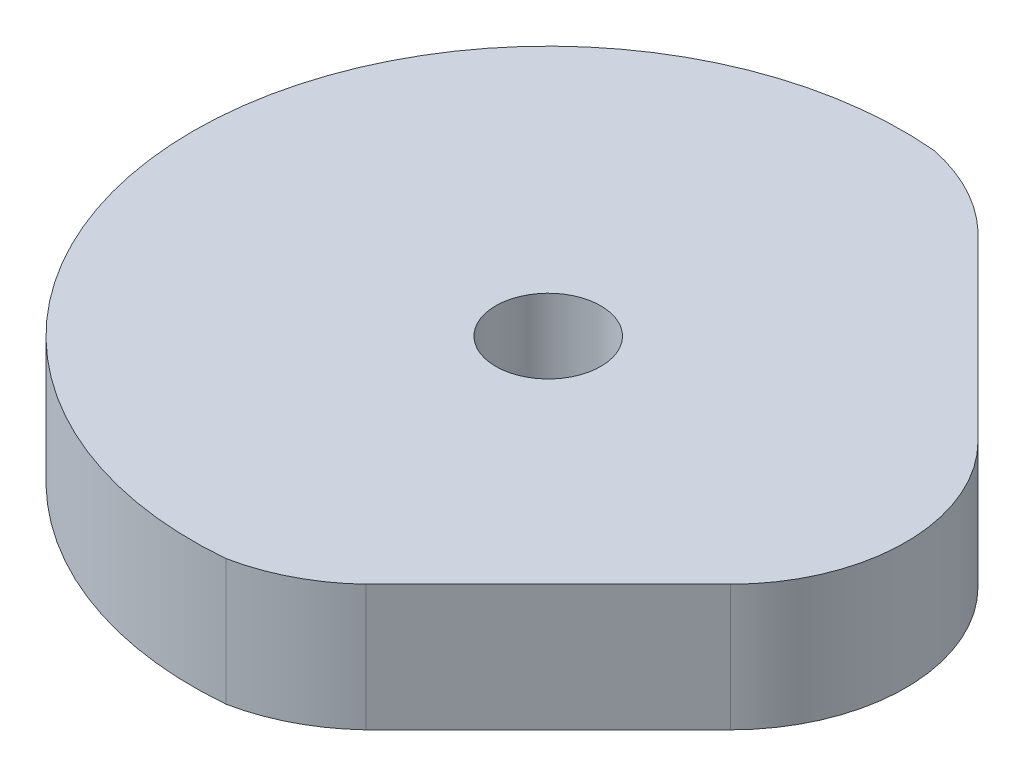
ISO-10303-21;
HEADER;
FILE_DESCRIPTION(('STEP AP214'),'2;1');
FILE_NAME('part.step','',(''),(''),'','','');
FILE_SCHEMA(('AUTOMOTIVE_DESIGN { 1 0 10303 214 1 1 1 1 }'));
ENDSEC;
DATA;
#1=APPLICATION_CONTEXT('core data for automotive mechanical design processes');
#2=APPLICATION_PROTOCOL_DEFINITION('international standard','automotive_design',2000,#1);
#3=PRODUCT_CONTEXT('',#1,'mechanical');
#4=PRODUCT('Part','Part','',(#3));
#5=PRODUCT_RELATED_PRODUCT_CATEGORY('part','',(#4));
#6=PRODUCT_DEFINITION_FORMATION('','',#4);
#7=PRODUCT_DEFINITION_CONTEXT('part definition',#1,'design');
#8=PRODUCT_DEFINITION('design','',#6,#7);
#9=PRODUCT_DEFINITION_SHAPE('','',#8);
#10=(LENGTH_UNIT() NAMED_UNIT(*) SI_UNIT(.MILLI.,.METRE.));
#11=(NAMED_UNIT(*) PLANE_ANGLE_UNIT() SI_UNIT($,.RADIAN.));
#12=(NAMED_UNIT(*) SI_UNIT($,.STERADIAN.) SOLID_ANGLE_UNIT());
#13=UNCERTAINTY_MEASURE_WITH_UNIT(LENGTH_MEASURE(1.E-05),#10,'distance_accuracy_value','');
#14=(GEOMETRIC_REPRESENTATION_CONTEXT(3) GLOBAL_UNCERTAINTY_ASSIGNED_CONTEXT((#13)) GLOBAL_UNIT_ASSIGNED_CONTEXT((#10,
#11,#12)) REPRESENTATION_CONTEXT('',''));
#15=CARTESIAN_POINT('',(0.,0.,0.));
#16=DIRECTION('',(0.,0.,1.));
#17=DIRECTION('',(1.,0.,0.));
#18=AXIS2_PLACEMENT_3D('',#15,#16,#17);
#19=CARTESIAN_POINT('',(-0.124301483345422,3.,-4.03990509591925));
#20=DIRECTION('',(0.,-1.,0.));
#21=DIRECTION('',(0.,0.,-1.));
#22=AXIS2_PLACEMENT_3D('',#19,#20,#21);
#23=CYLINDRICAL_SURFACE('',#22,4.46182669006417);
#24=CARTESIAN_POINT('',(-0.124301483345422,0.,-4.03990509591925));
#25=DIRECTION('',(0.,1.,0.));
#26=DIRECTION('',(0.,0.,1.));
#27=AXIS2_PLACEMENT_3D('',#24,#25,#26);
#28=CIRCLE('',#27,4.46182669006417);
#29=CARTESIAN_POINT('',(0.752637129984886,0.,-8.4147052148526));
#30=VERTEX_POINT('',#29);
#31=CARTESIAN_POINT('',(2.94156744628055,0.,-7.2815628691154));
#32=VERTEX_POINT('',#31);
#33=EDGE_CURVE('E119',#30,#32,#28,.F.);
#34=ORIENTED_EDGE('',*,*,#33,.F.);
#35=DIRECTION('',(0.,-1.,0.));
#36=VECTOR('',#35,1.);
#37=CARTESIAN_POINT('',(0.752637129984886,3.,-8.4147052148526));
#38=LINE('',#37,#36);
#39=CARTESIAN_POINT('',(0.752637129984886,3.,-8.4147052148526));
#40=VERTEX_POINT('',#39);
#41=EDGE_CURVE('E11',#40,#30,#38,.T.);
#42=ORIENTED_EDGE('',*,*,#41,.F.);
#43=CARTESIAN_POINT('',(-0.124301483345422,3.,-4.03990509591925));
#44=DIRECTION('',(0.,1.,0.));
#45=DIRECTION('',(0.,0.,1.));
#46=AXIS2_PLACEMENT_3D('',#43,#44,#45);
#47=CIRCLE('',#46,4.46182669006417);
#48=CARTESIAN_POINT('',(2.94156744628055,3.,-7.2815628691154));
#49=VERTEX_POINT('',#48);
#50=EDGE_CURVE('E170',#40,#49,#47,.F.);
#51=ORIENTED_EDGE('',*,*,#50,.T.);
#52=DIRECTION('',(0.,-1.,0.));
#53=VECTOR('',#52,1.);
#54=CARTESIAN_POINT('',(2.94156744628055,3.,-7.2815628691154));
#55=LINE('',#54,#53);
#56=EDGE_CURVE('E79',#49,#32,#55,.T.);
#57=ORIENTED_EDGE('',*,*,#56,.T.);
#58=EDGE_LOOP('',(#34,#42,#51,#57));
#59=FACE_BOUND('',#58,.T.);
#60=ADVANCED_FACE('F34',(#59),#23,.T.);
#61=CARTESIAN_POINT('',(0.,3.,0.));
#62=DIRECTION('',(0.,-1.,0.));
#63=DIRECTION('',(0.,0.,-1.));
#64=AXIS2_PLACEMENT_3D('',#61,#62,#63);
#65=CYLINDRICAL_SURFACE('',#64,8.44829725461287);
#66=CARTESIAN_POINT('',(0.,0.,0.));
#67=DIRECTION('',(0.,1.,0.));
#68=DIRECTION('',(0.,0.,1.));
#69=AXIS2_PLACEMENT_3D('',#66,#67,#68);
#70=CIRCLE('',#69,8.44829725461287);
#71=CARTESIAN_POINT('',(0.752637129984888,0.,8.4147052148526));
#72=VERTEX_POINT('',#71);
#73=EDGE_CURVE('E122',#30,#72,#70,.T.);
#74=ORIENTED_EDGE('',*,*,#73,.T.);
#75=DIRECTION('',(0.,-1.,0.));
#76=VECTOR('',#75,1.);
#77=CARTESIAN_POINT('',(0.752637129984888,3.,8.4147052148526));
#78=LINE('',#77,#76);
#79=CARTESIAN_POINT('',(0.752637129984888,3.,8.4147052148526));
#80=VERTEX_POINT('',#79);
#81=EDGE_CURVE('E43',#80,#72,#78,.T.);
#82=ORIENTED_EDGE('',*,*,#81,.F.);
#83=CARTESIAN_POINT('',(0.,3.,0.));
#84=DIRECTION('',(0.,1.,0.));
#85=DIRECTION('',(0.,0.,1.));
#86=AXIS2_PLACEMENT_3D('',#83,#84,#85);
#87=CIRCLE('',#86,8.44829725461287);
#88=EDGE_CURVE('E172',#40,#80,#87,.T.);
#89=ORIENTED_EDGE('',*,*,#88,.F.);
#90=ORIENTED_EDGE('',*,*,#41,.T.);
#91=EDGE_LOOP('',(#74,#82,#89,#90));
#92=FACE_BOUND('',#91,.T.);
#93=ADVANCED_FACE('F142',(#92),#65,.T.);
#94=CARTESIAN_POINT('',(-0.124301483345421,3.,4.03990509591925));
#95=DIRECTION('',(0.,-1.,0.));
#96=DIRECTION('',(0.,0.,-1.));
#97=AXIS2_PLACEMENT_3D('',#94,#95,#96);
#98=CYLINDRICAL_SURFACE('',#97,4.46182669006417);
#99=CARTESIAN_POINT('',(-0.124301483345421,0.,4.03990509591925));
#100=DIRECTION('',(0.,1.,0.));
#101=DIRECTION('',(0.,0.,1.));
#102=AXIS2_PLACEMENT_3D('',#99,#100,#101);
#103=CIRCLE('',#102,4.46182669006417);
#104=CARTESIAN_POINT('',(2.94156744628055,0.,7.2815628691154));
#105=VERTEX_POINT('',#104);
#106=EDGE_CURVE('E125',#72,#105,#103,.T.);
#107=ORIENTED_EDGE('',*,*,#106,.T.);
#108=DIRECTION('',(0.,-1.,0.));
#109=VECTOR('',#108,1.);
#110=CARTESIAN_POINT('',(2.94156744628055,3.,7.2815628691154));
#111=LINE('',#110,#109);
#112=CARTESIAN_POINT('',(2.94156744628055,3.,7.2815628691154));
#113=VERTEX_POINT('',#112);
#114=EDGE_CURVE('E103',#113,#105,#111,.T.);
#115=ORIENTED_EDGE('',*,*,#114,.F.);
#116=CARTESIAN_POINT('',(-0.124301483345421,3.,4.03990509591925));
#117=DIRECTION('',(0.,1.,0.));
#118=DIRECTION('',(0.,0.,1.));
#119=AXIS2_PLACEMENT_3D('',#116,#117,#118);
#120=CIRCLE('',#119,4.46182669006417);
#121=EDGE_CURVE('E108',#80,#113,#120,.T.);
#122=ORIENTED_EDGE('',*,*,#121,.F.);
#123=ORIENTED_EDGE('',*,*,#81,.T.);
#124=EDGE_LOOP('',(#107,#115,#122,#123));
#125=FACE_BOUND('',#124,.T.);
#126=ADVANCED_FACE('F139',(#125),#98,.T.);
#127=CARTESIAN_POINT('',(5.11156515769798,3.,5.11156515769798));
#128=DIRECTION('',(0.707106781186547,0.,0.707106781186547));
#129=DIRECTION('',(0.707106781186548,0.,-0.707106781186548));
#130=AXIS2_PLACEMENT_3D('',#127,#128,#129);
#131=PLANE('',#130);
#132=DIRECTION('',(-0.707106781186548,0.,0.707106781186548));
#133=VECTOR('',#132,1.);
#134=CARTESIAN_POINT('',(5.11156515769798,0.,5.11156515769798));
#135=LINE('',#134,#133);
#136=CARTESIAN_POINT('',(7.2815628691154,0.,2.94156744628055));
#137=VERTEX_POINT('',#136);
#138=EDGE_CURVE('E98',#137,#105,#135,.T.);
#139=ORIENTED_EDGE('',*,*,#138,.F.);
#140=DIRECTION('',(0.,-1.,0.));
#141=VECTOR('',#140,1.);
#142=CARTESIAN_POINT('',(7.2815628691154,3.,2.94156744628055));
#143=LINE('',#142,#141);
#144=CARTESIAN_POINT('',(7.2815628691154,3.,2.94156744628055));
#145=VERTEX_POINT('',#144);
#146=EDGE_CURVE('E93',#145,#137,#143,.T.);
#147=ORIENTED_EDGE('',*,*,#146,.F.);
#148=DIRECTION('',(-0.707106781186548,0.,0.707106781186548));
#149=VECTOR('',#148,1.);
#150=CARTESIAN_POINT('',(5.11156515769798,3.,5.11156515769798));
#151=LINE('',#150,#149);
#152=EDGE_CURVE('E96',#145,#113,#151,.T.);
#153=ORIENTED_EDGE('',*,*,#152,.T.);
#154=ORIENTED_EDGE('',*,*,#114,.T.);
#155=EDGE_LOOP('',(#139,#147,#153,#154));
#156=FACE_BOUND('',#155,.T.);
#157=ADVANCED_FACE('F95',(#156),#131,.T.);
#158=CARTESIAN_POINT('',(4.33999542283486,3.,0.));
#159=DIRECTION('',(0.,-1.,0.));
#160=DIRECTION('',(0.,0.,-1.));
#161=AXIS2_PLACEMENT_3D('',#158,#159,#160);
#162=CYLINDRICAL_SURFACE('',#161,4.16000457716514);
#163=CARTESIAN_POINT('',(4.33999542283486,0.,0.));
#164=DIRECTION('',(0.,1.,0.));
#165=DIRECTION('',(0.,0.,1.));
#166=AXIS2_PLACEMENT_3D('',#163,#164,#165);
#167=CIRCLE('',#166,4.16000457716514);
#168=CARTESIAN_POINT('',(7.2815628691154,0.,-2.94156744628055));
#169=VERTEX_POINT('',#168);
#170=EDGE_CURVE('E129',#169,#137,#167,.F.);
#171=ORIENTED_EDGE('',*,*,#170,.F.);
#172=DIRECTION('',(0.,-1.,0.));
#173=VECTOR('',#172,1.);
#174=CARTESIAN_POINT('',(7.2815628691154,3.,-2.94156744628055));
#175=LINE('',#174,#173);
#176=CARTESIAN_POINT('',(7.2815628691154,3.,-2.94156744628055));
#177=VERTEX_POINT('',#176);
#178=EDGE_CURVE('E72',#177,#169,#175,.T.);
#179=ORIENTED_EDGE('',*,*,#178,.F.);
#180=CARTESIAN_POINT('',(4.33999542283486,3.,0.));
#181=DIRECTION('',(0.,1.,0.));
#182=DIRECTION('',(0.,0.,1.));
#183=AXIS2_PLACEMENT_3D('',#180,#181,#182);
#184=CIRCLE('',#183,4.16000457716514);
#185=EDGE_CURVE('E106',#177,#145,#184,.F.);
#186=ORIENTED_EDGE('',*,*,#185,.T.);
#187=ORIENTED_EDGE('',*,*,#146,.T.);
#188=EDGE_LOOP('',(#171,#179,#186,#187));
#189=FACE_BOUND('',#188,.T.);
#190=ADVANCED_FACE('F111',(#189),#162,.T.);
#191=CARTESIAN_POINT('',(0.,3.,0.));
#192=DIRECTION('',(0.,-1.,0.));
#193=DIRECTION('',(0.,0.,-1.));
#194=AXIS2_PLACEMENT_3D('',#191,#192,#193);
#195=CYLINDRICAL_SURFACE('',#194,1.25);
#196=CARTESIAN_POINT('',(0.,3.,0.));
#197=DIRECTION('',(0.,1.,0.));
#198=DIRECTION('',(0.,0.,1.));
#199=AXIS2_PLACEMENT_3D('',#196,#197,#198);
#200=CIRCLE('',#199,1.25);
#201=CARTESIAN_POINT('',(0.,3.,1.25));
#202=VERTEX_POINT('',#201);
#203=EDGE_CURVE('E133',#202,#202,#200,.T.);
#204=ORIENTED_EDGE('',*,*,#203,.T.);
#205=EDGE_LOOP('',(#204));
#206=FACE_BOUND('',#205,.T.);
#207=CARTESIAN_POINT('',(0.,0.,0.));
#208=DIRECTION('',(0.,1.,0.));
#209=DIRECTION('',(0.,0.,1.));
#210=AXIS2_PLACEMENT_3D('',#207,#208,#209);
#211=CIRCLE('',#210,1.25);
#212=CARTESIAN_POINT('',(0.,0.,1.25));
#213=VERTEX_POINT('',#212);
#214=EDGE_CURVE('E116',#213,#213,#211,.T.);
#215=ORIENTED_EDGE('',*,*,#214,.F.);
#216=EDGE_LOOP('',(#215));
#217=FACE_BOUND('',#216,.T.);
#218=ADVANCED_FACE('F36',(#206,#217),#195,.F.);
#219=CARTESIAN_POINT('',(5.11156515769798,3.,-5.11156515769798));
#220=DIRECTION('',(-0.707106781186547,0.,0.707106781186548));
#221=DIRECTION('',(0.707106781186548,0.,0.707106781186547));
#222=AXIS2_PLACEMENT_3D('',#219,#220,#221);
#223=PLANE('',#222);
#224=DIRECTION('',(-0.707106781186548,0.,-0.707106781186547));
#225=VECTOR('',#224,1.);
#226=CARTESIAN_POINT('',(5.11156515769798,0.,-5.11156515769798));
#227=LINE('',#226,#225);
#228=EDGE_CURVE('E131',#169,#32,#227,.T.);
#229=ORIENTED_EDGE('',*,*,#228,.T.);
#230=ORIENTED_EDGE('',*,*,#56,.F.);
#231=DIRECTION('',(-0.707106781186548,0.,-0.707106781186547));
#232=VECTOR('',#231,1.);
#233=CARTESIAN_POINT('',(5.11156515769798,3.,-5.11156515769798));
#234=LINE('',#233,#232);
#235=EDGE_CURVE('E51',#177,#49,#234,.T.);
#236=ORIENTED_EDGE('',*,*,#235,.F.);
#237=ORIENTED_EDGE('',*,*,#178,.T.);
#238=EDGE_LOOP('',(#229,#230,#236,#237));
#239=FACE_BOUND('',#238,.T.);
#240=ADVANCED_FACE('F157',(#239),#223,.F.);
#241=CARTESIAN_POINT('',(0.,3.,0.));
#242=DIRECTION('',(0.,1.,0.));
#243=DIRECTION('',(0.,0.,1.));
#244=AXIS2_PLACEMENT_3D('',#241,#242,#243);
#245=PLANE('',#244);
#246=ORIENTED_EDGE('',*,*,#203,.F.);
#247=EDGE_LOOP('',(#246));
#248=FACE_BOUND('',#247,.T.);
#249=ORIENTED_EDGE('',*,*,#50,.F.);
#250=ORIENTED_EDGE('',*,*,#88,.T.);
#251=ORIENTED_EDGE('',*,*,#121,.T.);
#252=ORIENTED_EDGE('',*,*,#152,.F.);
#253=ORIENTED_EDGE('',*,*,#185,.F.);
#254=ORIENTED_EDGE('',*,*,#235,.T.);
#255=EDGE_LOOP('',(#249,#250,#251,#252,#253,#254));
#256=FACE_BOUND('',#255,.T.);
#257=ADVANCED_FACE('F105',(#248,#256),#245,.T.);
#258=CARTESIAN_POINT('',(0.,0.,0.));
#259=DIRECTION('',(0.,1.,0.));
#260=DIRECTION('',(0.,0.,1.));
#261=AXIS2_PLACEMENT_3D('',#258,#259,#260);
#262=PLANE('',#261);
#263=ORIENTED_EDGE('',*,*,#214,.T.);
#264=EDGE_LOOP('',(#263));
#265=FACE_BOUND('',#264,.T.);
#266=ORIENTED_EDGE('',*,*,#33,.T.);
#267=ORIENTED_EDGE('',*,*,#228,.F.);
#268=ORIENTED_EDGE('',*,*,#170,.T.);
#269=ORIENTED_EDGE('',*,*,#138,.T.);
#270=ORIENTED_EDGE('',*,*,#106,.F.);
#271=ORIENTED_EDGE('',*,*,#73,.F.);
#272=EDGE_LOOP('',(#266,#267,#268,#269,#270,#271));
#273=FACE_BOUND('',#272,.T.);
#274=ADVANCED_FACE('F144',(#265,#273),#262,.F.);
#275=CLOSED_SHELL('',(#60,#93,#126,#157,#190,#218,#240,#257,#274));
#276=MANIFOLD_SOLID_BREP('B2',#275);
#277=ADVANCED_BREP_SHAPE_REPRESENTATION('',(#18,#276),#14);
#278=SHAPE_DEFINITION_REPRESENTATION(#9,#277);
ENDSEC;
END-ISO-10303-21;
